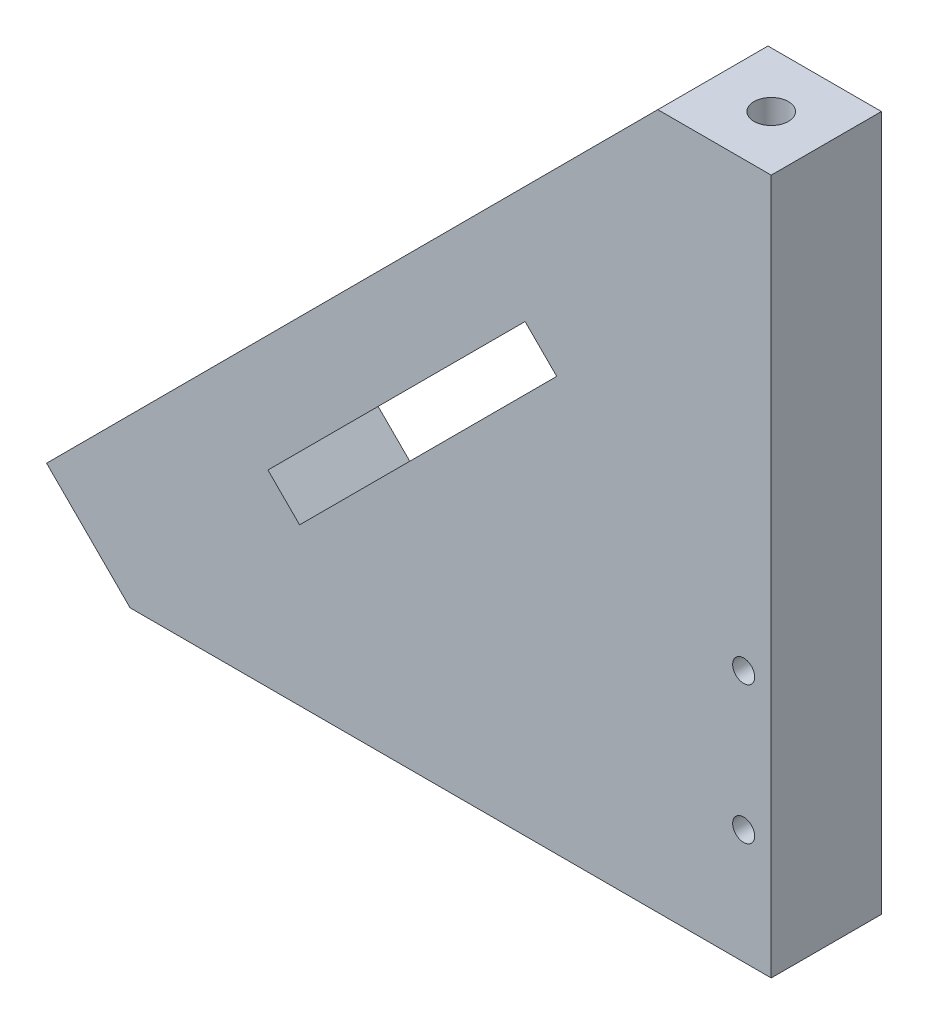
ISO-10303-21;
HEADER;
FILE_DESCRIPTION(('STEP AP214'),'2;1');
FILE_NAME('part.step','',(''),(''),'','','');
FILE_SCHEMA(('AUTOMOTIVE_DESIGN { 1 0 10303 214 1 1 1 1 }'));
ENDSEC;
DATA;
#1=APPLICATION_CONTEXT('core data for automotive mechanical design processes');
#2=APPLICATION_PROTOCOL_DEFINITION('international standard','automotive_design',2000,#1);
#3=PRODUCT_CONTEXT('',#1,'mechanical');
#4=PRODUCT('Part','Part','',(#3));
#5=PRODUCT_RELATED_PRODUCT_CATEGORY('part','',(#4));
#6=PRODUCT_DEFINITION_FORMATION('','',#4);
#7=PRODUCT_DEFINITION_CONTEXT('part definition',#1,'design');
#8=PRODUCT_DEFINITION('design','',#6,#7);
#9=PRODUCT_DEFINITION_SHAPE('','',#8);
#10=(LENGTH_UNIT() NAMED_UNIT(*) SI_UNIT(.MILLI.,.METRE.));
#11=(NAMED_UNIT(*) PLANE_ANGLE_UNIT() SI_UNIT($,.RADIAN.));
#12=(NAMED_UNIT(*) SI_UNIT($,.STERADIAN.) SOLID_ANGLE_UNIT());
#13=UNCERTAINTY_MEASURE_WITH_UNIT(LENGTH_MEASURE(1.E-05),#10,'distance_accuracy_value','');
#14=(GEOMETRIC_REPRESENTATION_CONTEXT(3) GLOBAL_UNCERTAINTY_ASSIGNED_CONTEXT((#13)) GLOBAL_UNIT_ASSIGNED_CONTEXT((#10,
#11,#12)) REPRESENTATION_CONTEXT('',''));
#15=CARTESIAN_POINT('',(0.,0.,0.));
#16=DIRECTION('',(0.,0.,1.));
#17=DIRECTION('',(1.,0.,0.));
#18=AXIS2_PLACEMENT_3D('',#15,#16,#17);
#19=CARTESIAN_POINT('',(51.3194404650338,17.4092423558568,4.));
#20=DIRECTION('',(-1.,0.,0.));
#21=DIRECTION('',(0.,0.,1.));
#22=AXIS2_PLACEMENT_3D('',#19,#20,#21);
#23=PLANE('',#22);
#24=DIRECTION('',(0.,1.,0.));
#25=VECTOR('',#24,1.);
#26=CARTESIAN_POINT('',(51.3194404650338,17.4092423558568,-4.));
#27=LINE('',#26,#25);
#28=CARTESIAN_POINT('',(51.3194404650338,14.1092423558568,-4.));
#29=VERTEX_POINT('',#28);
#30=CARTESIAN_POINT('',(51.3194404650338,64.5860213091515,-4.));
#31=VERTEX_POINT('',#30);
#32=EDGE_CURVE('E253',#29,#31,#27,.T.);
#33=ORIENTED_EDGE('',*,*,#32,.T.);
#34=DIRECTION('',(0.,0.,-1.));
#35=VECTOR('',#34,1.);
#36=CARTESIAN_POINT('',(51.3194404650338,64.5860213091515,4.));
#37=LINE('',#36,#35);
#38=CARTESIAN_POINT('',(51.3194404650338,64.5860213091515,4.));
#39=VERTEX_POINT('',#38);
#40=EDGE_CURVE('E198',#39,#31,#37,.T.);
#41=ORIENTED_EDGE('',*,*,#40,.F.);
#42=DIRECTION('',(0.,1.,0.));
#43=VECTOR('',#42,1.);
#44=CARTESIAN_POINT('',(51.3194404650338,17.4092423558568,4.));
#45=LINE('',#44,#43);
#46=CARTESIAN_POINT('',(51.3194404650338,14.1092423558568,4.));
#47=VERTEX_POINT('',#46);
#48=EDGE_CURVE('E260',#47,#39,#45,.T.);
#49=ORIENTED_EDGE('',*,*,#48,.F.);
#50=DIRECTION('',(0.,0.,-1.));
#51=VECTOR('',#50,1.);
#52=CARTESIAN_POINT('',(51.3194404650338,14.1092423558568,6.));
#53=LINE('',#52,#51);
#54=EDGE_CURVE('E228',#47,#29,#53,.T.);
#55=ORIENTED_EDGE('',*,*,#54,.T.);
#56=EDGE_LOOP('',(#33,#41,#49,#55));
#57=FACE_BOUND('',#56,.T.);
#58=ADVANCED_FACE('F39',(#57),#23,.F.);
#59=CARTESIAN_POINT('',(43.0840368947245,64.5860213091515,4.));
#60=DIRECTION('',(0.707459642969067,-0.706753743230328,0.));
#61=DIRECTION('',(0.706753743230328,0.707459642969067,0.));
#62=AXIS2_PLACEMENT_3D('',#59,#60,#61);
#63=PLANE('',#62);
#64=CARTESIAN_POINT('',(36.0164994624212,57.5114248794608,0.));
#65=DIRECTION('',(-0.707459642969066,0.706753743230328,0.));
#66=DIRECTION('',(-0.706753743230328,-0.707459642969066,0.));
#67=AXIS2_PLACEMENT_3D('',#64,#65,#66);
#68=CIRCLE('',#67,1.5);
#69=CARTESIAN_POINT('',(34.9563688475757,56.4502354150072,0.));
#70=VERTEX_POINT('',#69);
#71=EDGE_CURVE('E188',#70,#70,#68,.T.);
#72=ORIENTED_EDGE('',*,*,#71,.F.);
#73=EDGE_LOOP('',(#72));
#74=FACE_BOUND('',#73,.T.);
#75=CARTESIAN_POINT('',(8.77649946242108,30.244217794861,0.));
#76=DIRECTION('',(0.707459642969067,-0.706753743230328,0.));
#77=DIRECTION('',(-0.706753743230328,-0.707459642969067,0.));
#78=AXIS2_PLACEMENT_3D('',#75,#76,#77);
#79=ELLIPSE('',#78,2.40536398467433,1.7);
#80=CARTESIAN_POINT('',(7.07649946242108,28.5425198490526,0.));
#81=VERTEX_POINT('',#80);
#82=EDGE_CURVE('E42',#81,#81,#79,.T.);
#83=ORIENTED_EDGE('',*,*,#82,.T.);
#84=EDGE_LOOP('',(#83));
#85=FACE_BOUND('',#84,.T.);
#86=DIRECTION('',(0.706753743230328,0.707459642969066,0.));
#87=VECTOR('',#86,1.);
#88=CARTESIAN_POINT('',(29.2039664903129,50.6920876062912,-2.));
#89=LINE('',#88,#87);
#90=CARTESIAN_POINT('',(10.5456653447002,32.0151507052542,-2.));
#91=VERTEX_POINT('',#90);
#92=CARTESIAN_POINT('',(29.2039664903129,50.6920876062912,-2.));
#93=VERTEX_POINT('',#92);
#94=EDGE_CURVE('E163',#91,#93,#89,.T.);
#95=ORIENTED_EDGE('',*,*,#94,.F.);
#96=DIRECTION('',(0.,0.,-1.));
#97=VECTOR('',#96,1.);
#98=CARTESIAN_POINT('',(10.5456653447002,32.0151507052542,-2.));
#99=LINE('',#98,#97);
#100=CARTESIAN_POINT('',(10.5456653447002,32.0151507052542,-4.));
#101=VERTEX_POINT('',#100);
#102=EDGE_CURVE('E175',#91,#101,#99,.T.);
#103=ORIENTED_EDGE('',*,*,#102,.T.);
#104=DIRECTION('',(-0.706753743230328,-0.707459642969067,0.));
#105=VECTOR('',#104,1.);
#106=CARTESIAN_POINT('',(43.0840368947245,64.5860213091515,-4.));
#107=LINE('',#106,#105);
#108=CARTESIAN_POINT('',(-1.2859631052755,20.1717049235535,-4.));
#109=VERTEX_POINT('',#108);
#110=EDGE_CURVE('E270',#101,#109,#107,.T.);
#111=ORIENTED_EDGE('',*,*,#110,.T.);
#112=DIRECTION('',(0.,0.,-1.));
#113=VECTOR('',#112,1.);
#114=CARTESIAN_POINT('',(-1.2859631052755,20.1717049235535,4.));
#115=LINE('',#114,#113);
#116=CARTESIAN_POINT('',(-1.2859631052755,20.1717049235535,4.));
#117=VERTEX_POINT('',#116);
#118=EDGE_CURVE('E267',#117,#109,#115,.T.);
#119=ORIENTED_EDGE('',*,*,#118,.F.);
#120=DIRECTION('',(-0.706753743230328,-0.707459642969067,0.));
#121=VECTOR('',#120,1.);
#122=CARTESIAN_POINT('',(43.0840368947245,64.5860213091515,4.));
#123=LINE('',#122,#121);
#124=CARTESIAN_POINT('',(43.0840368947245,64.5860213091515,4.));
#125=VERTEX_POINT('',#124);
#126=EDGE_CURVE('E263',#125,#117,#123,.T.);
#127=ORIENTED_EDGE('',*,*,#126,.F.);
#128=DIRECTION('',(0.,0.,-1.));
#129=VECTOR('',#128,1.);
#130=CARTESIAN_POINT('',(43.0840368947245,64.5860213091515,4.));
#131=LINE('',#130,#129);
#132=CARTESIAN_POINT('',(43.0840368947245,64.5860213091515,-4.));
#133=VERTEX_POINT('',#132);
#134=EDGE_CURVE('E47',#125,#133,#131,.T.);
#135=ORIENTED_EDGE('',*,*,#134,.T.);
#136=CARTESIAN_POINT('',(29.2039664903129,50.6920876062912,-4.));
#137=VERTEX_POINT('',#136);
#138=EDGE_CURVE('E264',#133,#137,#107,.T.);
#139=ORIENTED_EDGE('',*,*,#138,.T.);
#140=DIRECTION('',(0.,0.,-1.));
#141=VECTOR('',#140,1.);
#142=CARTESIAN_POINT('',(29.2039664903129,50.6920876062912,-2.));
#143=LINE('',#142,#141);
#144=EDGE_CURVE('E173',#93,#137,#143,.T.);
#145=ORIENTED_EDGE('',*,*,#144,.F.);
#146=EDGE_LOOP('',(#95,#103,#111,#119,#127,#135,#139,#145));
#147=FACE_BOUND('',#146,.T.);
#148=ADVANCED_FACE('F280',(#74,#85,#147),#63,.F.);
#149=CARTESIAN_POINT('',(0.,0.,4.));
#150=DIRECTION('',(0.,0.,1.));
#151=DIRECTION('',(1.,0.,0.));
#152=AXIS2_PLACEMENT_3D('',#149,#150,#151);
#153=PLANE('',#152);
#154=DIRECTION('',(-1.,0.,0.));
#155=VECTOR('',#154,1.);
#156=CARTESIAN_POINT('',(43.0840368947245,64.5860213091515,4.));
#157=LINE('',#156,#155);
#158=EDGE_CURVE('E195',#39,#125,#157,.T.);
#159=ORIENTED_EDGE('',*,*,#158,.T.);
#160=ORIENTED_EDGE('',*,*,#126,.T.);
#161=DIRECTION('',(-0.707106781186541,0.707106781186554,0.));
#162=VECTOR('',#161,1.);
#163=CARTESIAN_POINT('',(9.44287090913897,9.44287090913881,4.));
#164=LINE('',#163,#162);
#165=CARTESIAN_POINT('',(4.77649946242108,14.1092423558568,4.));
#166=VERTEX_POINT('',#165);
#167=EDGE_CURVE('E224',#166,#117,#164,.T.);
#168=ORIENTED_EDGE('',*,*,#167,.F.);
#169=DIRECTION('',(-1.,0.,0.));
#170=VECTOR('',#169,1.);
#171=CARTESIAN_POINT('',(0.,14.1092423558568,4.));
#172=LINE('',#171,#170);
#173=EDGE_CURVE('E231',#47,#166,#172,.T.);
#174=ORIENTED_EDGE('',*,*,#173,.F.);
#175=ORIENTED_EDGE('',*,*,#48,.T.);
#176=EDGE_LOOP('',(#159,#160,#168,#174,#175));
#177=FACE_BOUND('',#176,.T.);
#178=CARTESIAN_POINT('',(49.3194404650338,32.4292423558568,4.));
#179=DIRECTION('',(0.,0.,1.));
#180=DIRECTION('',(1.,0.,0.));
#181=AXIS2_PLACEMENT_3D('',#178,#179,#180);
#182=CIRCLE('',#181,0.800000000000002);
#183=CARTESIAN_POINT('',(50.1194404650338,32.4292423558568,4.));
#184=VERTEX_POINT('',#183);
#185=EDGE_CURVE('E210',#184,#184,#182,.T.);
#186=ORIENTED_EDGE('',*,*,#185,.F.);
#187=EDGE_LOOP('',(#186));
#188=FACE_BOUND('',#187,.T.);
#189=CARTESIAN_POINT('',(49.3194404650338,22.4292423558568,4.));
#190=DIRECTION('',(0.,0.,1.));
#191=DIRECTION('',(1.,0.,0.));
#192=AXIS2_PLACEMENT_3D('',#189,#190,#191);
#193=CIRCLE('',#192,0.800000000000002);
#194=CARTESIAN_POINT('',(50.1194404650338,22.4292423558568,4.));
#195=VERTEX_POINT('',#194);
#196=EDGE_CURVE('E216',#195,#195,#193,.T.);
#197=ORIENTED_EDGE('',*,*,#196,.F.);
#198=EDGE_LOOP('',(#197));
#199=FACE_BOUND('',#198,.T.);
#200=DIRECTION('',(0.707106781186548,0.707106781186547,0.));
#201=VECTOR('',#200,1.);
#202=CARTESIAN_POINT('',(14.7831356012825,27.7776804486719,4.));
#203=LINE('',#202,#201);
#204=CARTESIAN_POINT('',(14.7831356012825,27.7776804486719,4.));
#205=VERTEX_POINT('',#204);
#206=CARTESIAN_POINT('',(33.4507546246073,46.4452994719968,4.));
#207=VERTEX_POINT('',#206);
#208=EDGE_CURVE('E234',#205,#207,#203,.T.);
#209=ORIENTED_EDGE('',*,*,#208,.T.);
#210=DIRECTION('',(0.707106781186547,-0.707106781186547,0.));
#211=VECTOR('',#210,1.);
#212=CARTESIAN_POINT('',(33.4507546246073,46.4452994719968,4.));
#213=LINE('',#212,#211);
#214=CARTESIAN_POINT('',(35.7488516634636,44.1472024331405,4.));
#215=VERTEX_POINT('',#214);
#216=EDGE_CURVE('E237',#207,#215,#213,.T.);
#217=ORIENTED_EDGE('',*,*,#216,.T.);
#218=DIRECTION('',(-0.707106781186547,-0.707106781186547,0.));
#219=VECTOR('',#218,1.);
#220=CARTESIAN_POINT('',(35.7488516634636,44.1472024331405,4.));
#221=LINE('',#220,#219);
#222=CARTESIAN_POINT('',(17.0812326401388,25.4795834098156,4.));
#223=VERTEX_POINT('',#222);
#224=EDGE_CURVE('E241',#215,#223,#221,.T.);
#225=ORIENTED_EDGE('',*,*,#224,.T.);
#226=DIRECTION('',(-0.707106781186547,0.707106781186548,0.));
#227=VECTOR('',#226,1.);
#228=CARTESIAN_POINT('',(17.0812326401388,25.4795834098156,4.));
#229=LINE('',#228,#227);
#230=EDGE_CURVE('E244',#223,#205,#229,.T.);
#231=ORIENTED_EDGE('',*,*,#230,.T.);
#232=EDGE_LOOP('',(#209,#217,#225,#231));
#233=FACE_BOUND('',#232,.T.);
#234=ADVANCED_FACE('F301',(#177,#188,#199,#233),#153,.T.);
#235=CARTESIAN_POINT('',(0.,0.,-4.));
#236=DIRECTION('',(0.,0.,1.));
#237=DIRECTION('',(1.,0.,0.));
#238=AXIS2_PLACEMENT_3D('',#235,#236,#237);
#239=PLANE('',#238);
#240=ORIENTED_EDGE('',*,*,#110,.F.);
#241=DIRECTION('',(-0.707106781186547,0.707106781186548,0.));
#242=VECTOR('',#241,1.);
#243=CARTESIAN_POINT('',(17.0812326401388,25.4795834098156,-4.));
#244=LINE('',#243,#242);
#245=CARTESIAN_POINT('',(21.6774267178513,20.8833893321031,-4.));
#246=VERTEX_POINT('',#245);
#247=EDGE_CURVE('E238',#246,#101,#244,.T.);
#248=ORIENTED_EDGE('',*,*,#247,.F.);
#249=DIRECTION('',(-0.707106781186547,-0.707106781186548,0.));
#250=VECTOR('',#249,1.);
#251=CARTESIAN_POINT('',(40.3450457411762,39.5510083554279,-4.));
#252=LINE('',#251,#250);
#253=CARTESIAN_POINT('',(40.3450457411762,39.5510083554279,-4.));
#254=VERTEX_POINT('',#253);
#255=EDGE_CURVE('E151',#254,#246,#252,.T.);
#256=ORIENTED_EDGE('',*,*,#255,.F.);
#257=DIRECTION('',(0.707106781186547,-0.707106781186547,0.));
#258=VECTOR('',#257,1.);
#259=CARTESIAN_POINT('',(33.4507546246073,46.4452994719968,-4.));
#260=LINE('',#259,#258);
#261=EDGE_CURVE('E158',#137,#254,#260,.T.);
#262=ORIENTED_EDGE('',*,*,#261,.F.);
#263=ORIENTED_EDGE('',*,*,#138,.F.);
#264=DIRECTION('',(-1.,0.,0.));
#265=VECTOR('',#264,1.);
#266=CARTESIAN_POINT('',(43.0840368947245,64.5860213091515,-4.));
#267=LINE('',#266,#265);
#268=EDGE_CURVE('E192',#31,#133,#267,.T.);
#269=ORIENTED_EDGE('',*,*,#268,.F.);
#270=ORIENTED_EDGE('',*,*,#32,.F.);
#271=DIRECTION('',(1.,0.,0.));
#272=VECTOR('',#271,1.);
#273=CARTESIAN_POINT('',(51.3194404650338,14.1092423558568,-4.));
#274=LINE('',#273,#272);
#275=CARTESIAN_POINT('',(4.77649946242109,14.1092423558568,-4.));
#276=VERTEX_POINT('',#275);
#277=EDGE_CURVE('E226',#276,#29,#274,.T.);
#278=ORIENTED_EDGE('',*,*,#277,.F.);
#279=DIRECTION('',(0.707106781186541,-0.707106781186554,0.));
#280=VECTOR('',#279,1.);
#281=CARTESIAN_POINT('',(-1.2859631052755,20.1717049235535,-4.));
#282=LINE('',#281,#280);
#283=EDGE_CURVE('E222',#109,#276,#282,.T.);
#284=ORIENTED_EDGE('',*,*,#283,.F.);
#285=EDGE_LOOP('',(#240,#248,#256,#262,#263,#269,#270,#278,#284));
#286=FACE_BOUND('',#285,.T.);
#287=ADVANCED_FACE('F287',(#286),#239,.F.);
#288=CARTESIAN_POINT('',(14.7831356012825,27.7776804486719,4.));
#289=DIRECTION('',(-0.707106781186547,0.707106781186548,0.));
#290=DIRECTION('',(-0.707106781186548,-0.707106781186547,0.));
#291=AXIS2_PLACEMENT_3D('',#288,#289,#290);
#292=PLANE('',#291);
#293=DIRECTION('',(0.,0.,-1.));
#294=VECTOR('',#293,1.);
#295=CARTESIAN_POINT('',(14.7831356012825,27.7776804486719,4.));
#296=LINE('',#295,#294);
#297=CARTESIAN_POINT('',(14.7831356012825,27.7776804486719,-2.));
#298=VERTEX_POINT('',#297);
#299=EDGE_CURVE('E250',#205,#298,#296,.T.);
#300=ORIENTED_EDGE('',*,*,#299,.T.);
#301=DIRECTION('',(0.707106781186548,0.707106781186547,0.));
#302=VECTOR('',#301,1.);
#303=CARTESIAN_POINT('',(14.7831356012825,27.7776804486719,-2.));
#304=LINE('',#303,#302);
#305=CARTESIAN_POINT('',(33.4507546246073,46.4452994719968,-2.));
#306=VERTEX_POINT('',#305);
#307=EDGE_CURVE('E180',#298,#306,#304,.T.);
#308=ORIENTED_EDGE('',*,*,#307,.T.);
#309=DIRECTION('',(0.,0.,-1.));
#310=VECTOR('',#309,1.);
#311=CARTESIAN_POINT('',(33.4507546246073,46.4452994719968,4.));
#312=LINE('',#311,#310);
#313=EDGE_CURVE('E247',#207,#306,#312,.T.);
#314=ORIENTED_EDGE('',*,*,#313,.F.);
#315=ORIENTED_EDGE('',*,*,#208,.F.);
#316=EDGE_LOOP('',(#300,#308,#314,#315));
#317=FACE_BOUND('',#316,.T.);
#318=ADVANCED_FACE('F335',(#317),#292,.F.);
#319=CARTESIAN_POINT('',(17.0812326401388,25.4795834098156,4.));
#320=DIRECTION('',(-0.707106781186548,-0.707106781186547,0.));
#321=DIRECTION('',(0.707106781186547,-0.707106781186548,0.));
#322=AXIS2_PLACEMENT_3D('',#319,#320,#321);
#323=PLANE('',#322);
#324=DIRECTION('',(0.,0.,-1.));
#325=VECTOR('',#324,1.);
#326=CARTESIAN_POINT('',(17.0812326401388,25.4795834098156,4.));
#327=LINE('',#326,#325);
#328=CARTESIAN_POINT('',(17.0812326401388,25.4795834098156,-2.));
#329=VERTEX_POINT('',#328);
#330=EDGE_CURVE('E254',#223,#329,#327,.T.);
#331=ORIENTED_EDGE('',*,*,#330,.T.);
#332=DIRECTION('',(-0.707106781186547,0.707106781186547,0.));
#333=VECTOR('',#332,1.);
#334=CARTESIAN_POINT('',(17.0812326401388,25.4795834098156,-2.));
#335=LINE('',#334,#333);
#336=CARTESIAN_POINT('',(21.6774267178513,20.8833893321031,-2.));
#337=VERTEX_POINT('',#336);
#338=EDGE_CURVE('E54',#337,#329,#335,.T.);
#339=ORIENTED_EDGE('',*,*,#338,.F.);
#340=DIRECTION('',(0.,0.,-1.));
#341=VECTOR('',#340,1.);
#342=CARTESIAN_POINT('',(21.6774267178513,20.8833893321031,-2.));
#343=LINE('',#342,#341);
#344=EDGE_CURVE('E162',#337,#246,#343,.T.);
#345=ORIENTED_EDGE('',*,*,#344,.T.);
#346=ORIENTED_EDGE('',*,*,#247,.T.);
#347=ORIENTED_EDGE('',*,*,#102,.F.);
#348=EDGE_CURVE('E167',#298,#91,#335,.T.);
#349=ORIENTED_EDGE('',*,*,#348,.F.);
#350=ORIENTED_EDGE('',*,*,#299,.F.);
#351=ORIENTED_EDGE('',*,*,#230,.F.);
#352=EDGE_LOOP('',(#331,#339,#345,#346,#347,#349,#350,#351));
#353=FACE_BOUND('',#352,.T.);
#354=ADVANCED_FACE('F293',(#353),#323,.F.);
#355=CARTESIAN_POINT('',(35.7488516634636,44.1472024331405,4.));
#356=DIRECTION('',(0.707106781186547,-0.707106781186547,0.));
#357=DIRECTION('',(0.707106781186548,0.707106781186548,0.));
#358=AXIS2_PLACEMENT_3D('',#355,#356,#357);
#359=PLANE('',#358);
#360=DIRECTION('',(0.,0.,-1.));
#361=VECTOR('',#360,1.);
#362=CARTESIAN_POINT('',(35.7488516634636,44.1472024331405,4.));
#363=LINE('',#362,#361);
#364=CARTESIAN_POINT('',(35.7488516634636,44.1472024331405,-2.));
#365=VERTEX_POINT('',#364);
#366=EDGE_CURVE('E257',#215,#365,#363,.T.);
#367=ORIENTED_EDGE('',*,*,#366,.T.);
#368=DIRECTION('',(-0.707106781186548,-0.707106781186548,0.));
#369=VECTOR('',#368,1.);
#370=CARTESIAN_POINT('',(35.7488516634636,44.1472024331405,-2.));
#371=LINE('',#370,#369);
#372=EDGE_CURVE('E147',#365,#329,#371,.T.);
#373=ORIENTED_EDGE('',*,*,#372,.T.);
#374=ORIENTED_EDGE('',*,*,#330,.F.);
#375=ORIENTED_EDGE('',*,*,#224,.F.);
#376=EDGE_LOOP('',(#367,#373,#374,#375));
#377=FACE_BOUND('',#376,.T.);
#378=ADVANCED_FACE('F318',(#377),#359,.F.);
#379=CARTESIAN_POINT('',(33.4507546246073,46.4452994719968,4.));
#380=DIRECTION('',(0.707106781186547,0.707106781186547,0.));
#381=DIRECTION('',(-0.707106781186548,0.707106781186548,0.));
#382=AXIS2_PLACEMENT_3D('',#379,#380,#381);
#383=PLANE('',#382);
#384=ORIENTED_EDGE('',*,*,#313,.T.);
#385=DIRECTION('',(0.707106781186548,-0.707106781186547,0.));
#386=VECTOR('',#385,1.);
#387=CARTESIAN_POINT('',(33.4507546246073,46.4452994719968,-2.));
#388=LINE('',#387,#386);
#389=EDGE_CURVE('E62',#93,#306,#388,.T.);
#390=ORIENTED_EDGE('',*,*,#389,.F.);
#391=ORIENTED_EDGE('',*,*,#144,.T.);
#392=ORIENTED_EDGE('',*,*,#261,.T.);
#393=DIRECTION('',(0.,0.,-1.));
#394=VECTOR('',#393,1.);
#395=CARTESIAN_POINT('',(40.3450457411762,39.5510083554279,-2.));
#396=LINE('',#395,#394);
#397=CARTESIAN_POINT('',(40.3450457411762,39.5510083554279,-2.));
#398=VERTEX_POINT('',#397);
#399=EDGE_CURVE('E154',#398,#254,#396,.T.);
#400=ORIENTED_EDGE('',*,*,#399,.F.);
#401=EDGE_CURVE('E142',#365,#398,#388,.T.);
#402=ORIENTED_EDGE('',*,*,#401,.F.);
#403=ORIENTED_EDGE('',*,*,#366,.F.);
#404=ORIENTED_EDGE('',*,*,#216,.F.);
#405=EDGE_LOOP('',(#384,#390,#391,#392,#400,#402,#403,#404));
#406=FACE_BOUND('',#405,.T.);
#407=ADVANCED_FACE('F156',(#406),#383,.F.);
#408=CARTESIAN_POINT('',(51.3194404650338,14.1092423558568,6.));
#409=DIRECTION('',(0.,1.,0.));
#410=DIRECTION('',(0.,0.,1.));
#411=AXIS2_PLACEMENT_3D('',#408,#409,#410);
#412=PLANE('',#411);
#413=CARTESIAN_POINT('',(8.77649946242108,14.1092423558568,0.));
#414=DIRECTION('',(0.,-1.,0.));
#415=DIRECTION('',(0.,0.,-1.));
#416=AXIS2_PLACEMENT_3D('',#413,#414,#415);
#417=CIRCLE('',#416,3.25);
#418=CARTESIAN_POINT('',(8.77649946242108,14.1092423558568,-3.25));
#419=VERTEX_POINT('',#418);
#420=EDGE_CURVE('E201',#419,#419,#417,.T.);
#421=ORIENTED_EDGE('',*,*,#420,.F.);
#422=EDGE_LOOP('',(#421));
#423=FACE_BOUND('',#422,.T.);
#424=ORIENTED_EDGE('',*,*,#173,.T.);
#425=DIRECTION('',(0.,0.,-1.));
#426=VECTOR('',#425,1.);
#427=CARTESIAN_POINT('',(4.77649946242108,14.1092423558568,6.));
#428=LINE('',#427,#426);
#429=EDGE_CURVE('E11',#166,#276,#428,.T.);
#430=ORIENTED_EDGE('',*,*,#429,.T.);
#431=ORIENTED_EDGE('',*,*,#277,.T.);
#432=ORIENTED_EDGE('',*,*,#54,.F.);
#433=EDGE_LOOP('',(#424,#430,#431,#432));
#434=FACE_BOUND('',#433,.T.);
#435=ADVANCED_FACE('F308',(#423,#434),#412,.F.);
#436=CARTESIAN_POINT('',(-1.2859631052755,20.1717049235535,6.));
#437=DIRECTION('',(0.707106781186554,0.707106781186541,0.));
#438=DIRECTION('',(-0.707106781186541,0.707106781186554,0.));
#439=AXIS2_PLACEMENT_3D('',#436,#437,#438);
#440=PLANE('',#439);
#441=ORIENTED_EDGE('',*,*,#167,.T.);
#442=ORIENTED_EDGE('',*,*,#118,.T.);
#443=ORIENTED_EDGE('',*,*,#283,.T.);
#444=ORIENTED_EDGE('',*,*,#429,.F.);
#445=EDGE_LOOP('',(#441,#442,#443,#444));
#446=FACE_BOUND('',#445,.T.);
#447=ADVANCED_FACE('F297',(#446),#440,.F.);
#448=CARTESIAN_POINT('',(49.3194404650338,22.4292423558568,-3.));
#449=DIRECTION('',(0.,0.,1.));
#450=DIRECTION('',(1.,0.,0.));
#451=AXIS2_PLACEMENT_3D('',#448,#449,#450);
#452=CONICAL_SURFACE('',#451,0.799999999999995,1.02974425867665);
#453=CARTESIAN_POINT('',(49.3194404650338,22.4292423558568,-3.48068849522205));
#454=VERTEX_POINT('',#453);
#455=VERTEX_LOOP('',#454);
#456=FACE_BOUND('',#455,.T.);
#457=CARTESIAN_POINT('',(49.3194404650338,22.4292423558568,-3.));
#458=DIRECTION('',(0.,0.,1.));
#459=DIRECTION('',(1.,0.,0.));
#460=AXIS2_PLACEMENT_3D('',#457,#458,#459);
#461=CIRCLE('',#460,0.799999999999995);
#462=CARTESIAN_POINT('',(50.1194404650338,22.4292423558568,-3.));
#463=VERTEX_POINT('',#462);
#464=EDGE_CURVE('E219',#463,#463,#461,.T.);
#465=ORIENTED_EDGE('',*,*,#464,.T.);
#466=EDGE_LOOP('',(#465));
#467=FACE_BOUND('',#466,.T.);
#468=ADVANCED_FACE('F316',(#456,#467),#452,.F.);
#469=CARTESIAN_POINT('',(49.3194404650338,22.4292423558568,4.));
#470=DIRECTION('',(0.,0.,1.));
#471=DIRECTION('',(1.,0.,0.));
#472=AXIS2_PLACEMENT_3D('',#469,#470,#471);
#473=CYLINDRICAL_SURFACE('',#472,0.799999999999999);
#474=ORIENTED_EDGE('',*,*,#464,.F.);
#475=EDGE_LOOP('',(#474));
#476=FACE_BOUND('',#475,.T.);
#477=ORIENTED_EDGE('',*,*,#196,.T.);
#478=EDGE_LOOP('',(#477));
#479=FACE_BOUND('',#478,.T.);
#480=ADVANCED_FACE('F422',(#476,#479),#473,.F.);
#481=CARTESIAN_POINT('',(49.3194404650338,32.4292423558568,-3.));
#482=DIRECTION('',(0.,0.,1.));
#483=DIRECTION('',(1.,0.,0.));
#484=AXIS2_PLACEMENT_3D('',#481,#482,#483);
#485=CONICAL_SURFACE('',#484,0.799999999999995,1.02974425867665);
#486=CARTESIAN_POINT('',(49.3194404650338,32.4292423558568,-3.48068849522205));
#487=VERTEX_POINT('',#486);
#488=VERTEX_LOOP('',#487);
#489=FACE_BOUND('',#488,.T.);
#490=CARTESIAN_POINT('',(49.3194404650338,32.4292423558568,-3.));
#491=DIRECTION('',(0.,0.,1.));
#492=DIRECTION('',(1.,0.,0.));
#493=AXIS2_PLACEMENT_3D('',#490,#491,#492);
#494=CIRCLE('',#493,0.799999999999995);
#495=CARTESIAN_POINT('',(50.1194404650338,32.4292423558568,-3.));
#496=VERTEX_POINT('',#495);
#497=EDGE_CURVE('E213',#496,#496,#494,.T.);
#498=ORIENTED_EDGE('',*,*,#497,.T.);
#499=EDGE_LOOP('',(#498));
#500=FACE_BOUND('',#499,.T.);
#501=ADVANCED_FACE('F418',(#489,#500),#485,.F.);
#502=CARTESIAN_POINT('',(49.3194404650338,32.4292423558568,4.));
#503=DIRECTION('',(0.,0.,1.));
#504=DIRECTION('',(1.,0.,0.));
#505=AXIS2_PLACEMENT_3D('',#502,#503,#504);
#506=CYLINDRICAL_SURFACE('',#505,0.799999999999999);
#507=ORIENTED_EDGE('',*,*,#497,.F.);
#508=EDGE_LOOP('',(#507));
#509=FACE_BOUND('',#508,.T.);
#510=ORIENTED_EDGE('',*,*,#185,.T.);
#511=EDGE_LOOP('',(#510));
#512=FACE_BOUND('',#511,.T.);
#513=ADVANCED_FACE('F414',(#509,#512),#506,.F.);
#514=CARTESIAN_POINT('',(8.77649946242108,14.1092423558568,0.));
#515=DIRECTION('',(0.,-1.,0.));
#516=DIRECTION('',(0.,0.,-1.));
#517=AXIS2_PLACEMENT_3D('',#514,#515,#516);
#518=CYLINDRICAL_SURFACE('',#517,1.7);
#519=CARTESIAN_POINT('',(8.77649946242108,17.1092423558568,0.));
#520=DIRECTION('',(0.,-1.,0.));
#521=DIRECTION('',(0.,0.,-1.));
#522=AXIS2_PLACEMENT_3D('',#519,#520,#521);
#523=CIRCLE('',#522,1.70000000000001);
#524=CARTESIAN_POINT('',(8.77649946242108,17.1092423558568,-1.70000000000001));
#525=VERTEX_POINT('',#524);
#526=EDGE_CURVE('E207',#525,#525,#523,.T.);
#527=ORIENTED_EDGE('',*,*,#526,.T.);
#528=EDGE_LOOP('',(#527));
#529=FACE_BOUND('',#528,.T.);
#530=ORIENTED_EDGE('',*,*,#82,.F.);
#531=EDGE_LOOP('',(#530));
#532=FACE_BOUND('',#531,.T.);
#533=ADVANCED_FACE('F410',(#529,#532),#518,.F.);
#534=CARTESIAN_POINT('',(10.4764994624211,17.1092423558568,0.));
#535=DIRECTION('',(0.,1.,0.));
#536=DIRECTION('',(0.,0.,1.));
#537=AXIS2_PLACEMENT_3D('',#534,#535,#536);
#538=PLANE('',#537);
#539=ORIENTED_EDGE('',*,*,#526,.F.);
#540=EDGE_LOOP('',(#539));
#541=FACE_BOUND('',#540,.T.);
#542=CARTESIAN_POINT('',(8.77649946242108,17.1092423558568,0.));
#543=DIRECTION('',(0.,-1.,0.));
#544=DIRECTION('',(0.,0.,-1.));
#545=AXIS2_PLACEMENT_3D('',#542,#543,#544);
#546=CIRCLE('',#545,3.25);
#547=CARTESIAN_POINT('',(8.77649946242108,17.1092423558568,-3.25));
#548=VERTEX_POINT('',#547);
#549=EDGE_CURVE('E204',#548,#548,#546,.T.);
#550=ORIENTED_EDGE('',*,*,#549,.T.);
#551=EDGE_LOOP('',(#550));
#552=FACE_BOUND('',#551,.T.);
#553=ADVANCED_FACE('F406',(#541,#552),#538,.F.);
#554=CARTESIAN_POINT('',(8.77649946242108,14.1092423558568,0.));
#555=DIRECTION('',(0.,-1.,0.));
#556=DIRECTION('',(0.,0.,-1.));
#557=AXIS2_PLACEMENT_3D('',#554,#555,#556);
#558=CYLINDRICAL_SURFACE('',#557,3.25);
#559=ORIENTED_EDGE('',*,*,#549,.F.);
#560=EDGE_LOOP('',(#559));
#561=FACE_BOUND('',#560,.T.);
#562=ORIENTED_EDGE('',*,*,#420,.T.);
#563=EDGE_LOOP('',(#562));
#564=FACE_BOUND('',#563,.T.);
#565=ADVANCED_FACE('F402',(#561,#564),#558,.F.);
#566=CARTESIAN_POINT('',(43.0840368947245,64.5860213091515,4.));
#567=DIRECTION('',(0.,-1.,0.));
#568=DIRECTION('',(0.,0.,-1.));
#569=AXIS2_PLACEMENT_3D('',#566,#567,#568);
#570=PLANE('',#569);
#571=CARTESIAN_POINT('',(47.3194404650338,64.5860213091515,0.));
#572=DIRECTION('',(0.,1.,0.));
#573=DIRECTION('',(0.,0.,1.));
#574=AXIS2_PLACEMENT_3D('',#571,#572,#573);
#575=CIRCLE('',#574,1.24999999999999);
#576=CARTESIAN_POINT('',(47.3194404650338,64.5860213091515,1.24999999999999));
#577=VERTEX_POINT('',#576);
#578=EDGE_CURVE('E182',#577,#577,#575,.T.);
#579=ORIENTED_EDGE('',*,*,#578,.F.);
#580=EDGE_LOOP('',(#579));
#581=FACE_BOUND('',#580,.T.);
#582=ORIENTED_EDGE('',*,*,#268,.T.);
#583=ORIENTED_EDGE('',*,*,#134,.F.);
#584=ORIENTED_EDGE('',*,*,#158,.F.);
#585=ORIENTED_EDGE('',*,*,#40,.T.);
#586=EDGE_LOOP('',(#582,#583,#584,#585));
#587=FACE_BOUND('',#586,.T.);
#588=ADVANCED_FACE('F305',(#581,#587),#570,.F.);
#589=CARTESIAN_POINT('',(39.9075274987511,53.624279291694,0.));
#590=DIRECTION('',(-0.707459642969067,0.706753743230329,0.));
#591=DIRECTION('',(-0.706753743230328,-0.707459642969066,0.));
#592=AXIS2_PLACEMENT_3D('',#589,#590,#591);
#593=CYLINDRICAL_SURFACE('',#592,1.5);
#594=CARTESIAN_POINT('',(39.9075274987511,53.624279291694,0.));
#595=DIRECTION('',(-0.707459642969066,0.706753743230328,0.));
#596=DIRECTION('',(-0.706753743230328,-0.707459642969066,0.));
#597=AXIS2_PLACEMENT_3D('',#594,#595,#596);
#598=CIRCLE('',#597,1.5);
#599=CARTESIAN_POINT('',(38.8473968839056,52.5630898272404,0.));
#600=VERTEX_POINT('',#599);
#601=EDGE_CURVE('E189',#600,#600,#598,.T.);
#602=ORIENTED_EDGE('',*,*,#601,.F.);
#603=EDGE_LOOP('',(#602));
#604=FACE_BOUND('',#603,.T.);
#605=ORIENTED_EDGE('',*,*,#71,.T.);
#606=EDGE_LOOP('',(#605));
#607=FACE_BOUND('',#606,.T.);
#608=ADVANCED_FACE('F395',(#604,#607),#593,.F.);
#609=CARTESIAN_POINT('',(39.9075274987511,53.624279291694,0.));
#610=DIRECTION('',(-0.707459642969066,0.706753743230328,0.));
#611=DIRECTION('',(-0.706753743230328,-0.707459642969066,0.));
#612=AXIS2_PLACEMENT_3D('',#609,#610,#611);
#613=PLANE('',#612);
#614=ORIENTED_EDGE('',*,*,#601,.T.);
#615=EDGE_LOOP('',(#614));
#616=FACE_BOUND('',#615,.T.);
#617=ADVANCED_FACE('F391',(#616),#613,.T.);
#618=CARTESIAN_POINT('',(47.3194404650338,56.0860213091515,0.));
#619=DIRECTION('',(0.,1.,0.));
#620=DIRECTION('',(0.,0.,1.));
#621=AXIS2_PLACEMENT_3D('',#618,#619,#620);
#622=CONICAL_SURFACE('',#621,1.24999999999999,1.02974425867665);
#623=CARTESIAN_POINT('',(47.3194404650338,55.334945535367,0.));
#624=VERTEX_POINT('',#623);
#625=VERTEX_LOOP('',#624);
#626=FACE_BOUND('',#625,.T.);
#627=CARTESIAN_POINT('',(47.3194404650338,56.0860213091515,0.));
#628=DIRECTION('',(0.,1.,0.));
#629=DIRECTION('',(0.,0.,1.));
#630=AXIS2_PLACEMENT_3D('',#627,#628,#629);
#631=CIRCLE('',#630,1.24999999999999);
#632=CARTESIAN_POINT('',(47.3194404650338,56.0860213091515,1.24999999999999));
#633=VERTEX_POINT('',#632);
#634=EDGE_CURVE('E185',#633,#633,#631,.T.);
#635=ORIENTED_EDGE('',*,*,#634,.T.);
#636=EDGE_LOOP('',(#635));
#637=FACE_BOUND('',#636,.T.);
#638=ADVANCED_FACE('F387',(#626,#637),#622,.F.);
#639=CARTESIAN_POINT('',(47.3194404650338,64.5860213091515,0.));
#640=DIRECTION('',(0.,1.,0.));
#641=DIRECTION('',(0.,0.,1.));
#642=AXIS2_PLACEMENT_3D('',#639,#640,#641);
#643=CYLINDRICAL_SURFACE('',#642,1.24999999999999);
#644=ORIENTED_EDGE('',*,*,#634,.F.);
#645=EDGE_LOOP('',(#644));
#646=FACE_BOUND('',#645,.T.);
#647=ORIENTED_EDGE('',*,*,#578,.T.);
#648=EDGE_LOOP('',(#647));
#649=FACE_BOUND('',#648,.T.);
#650=ADVANCED_FACE('F365',(#646,#649),#643,.F.);
#651=CARTESIAN_POINT('',(0.,0.,-2.));
#652=DIRECTION('',(0.,0.,1.));
#653=DIRECTION('',(1.,0.,0.));
#654=AXIS2_PLACEMENT_3D('',#651,#652,#653);
#655=PLANE('',#654);
#656=ORIENTED_EDGE('',*,*,#401,.T.);
#657=DIRECTION('',(-0.707106781186547,-0.707106781186548,0.));
#658=VECTOR('',#657,1.);
#659=CARTESIAN_POINT('',(40.3450457411762,39.5510083554279,-2.));
#660=LINE('',#659,#658);
#661=EDGE_CURVE('E146',#398,#337,#660,.T.);
#662=ORIENTED_EDGE('',*,*,#661,.T.);
#663=ORIENTED_EDGE('',*,*,#338,.T.);
#664=ORIENTED_EDGE('',*,*,#372,.F.);
#665=EDGE_LOOP('',(#656,#662,#663,#664));
#666=FACE_BOUND('',#665,.T.);
#667=ADVANCED_FACE('F144',(#666),#655,.F.);
#668=CARTESIAN_POINT('',(40.3450457411762,39.5510083554279,-2.));
#669=DIRECTION('',(0.707106781186548,-0.707106781186547,0.));
#670=DIRECTION('',(0.707106781186547,0.707106781186548,0.));
#671=AXIS2_PLACEMENT_3D('',#668,#669,#670);
#672=PLANE('',#671);
#673=ORIENTED_EDGE('',*,*,#255,.T.);
#674=ORIENTED_EDGE('',*,*,#344,.F.);
#675=ORIENTED_EDGE('',*,*,#661,.F.);
#676=ORIENTED_EDGE('',*,*,#399,.T.);
#677=EDGE_LOOP('',(#673,#674,#675,#676));
#678=FACE_BOUND('',#677,.T.);
#679=ADVANCED_FACE('F165',(#678),#672,.F.);
#680=ORIENTED_EDGE('',*,*,#348,.T.);
#681=ORIENTED_EDGE('',*,*,#94,.T.);
#682=ORIENTED_EDGE('',*,*,#389,.T.);
#683=ORIENTED_EDGE('',*,*,#307,.F.);
#684=EDGE_LOOP('',(#680,#681,#682,#683));
#685=FACE_BOUND('',#684,.T.);
#686=ADVANCED_FACE('F290',(#685),#655,.F.);
#687=CLOSED_SHELL('',(#58,#148,#234,#287,#318,#354,#378,#407,#435,#447,#468,#480,#501,#513,#533,
#553,#565,#588,#608,#617,#638,#650,#667,#679,#686));
#688=MANIFOLD_SOLID_BREP('B2',#687);
#689=ADVANCED_BREP_SHAPE_REPRESENTATION('',(#18,#688),#14);
#690=SHAPE_DEFINITION_REPRESENTATION(#9,#689);
ENDSEC;
END-ISO-10303-21;
